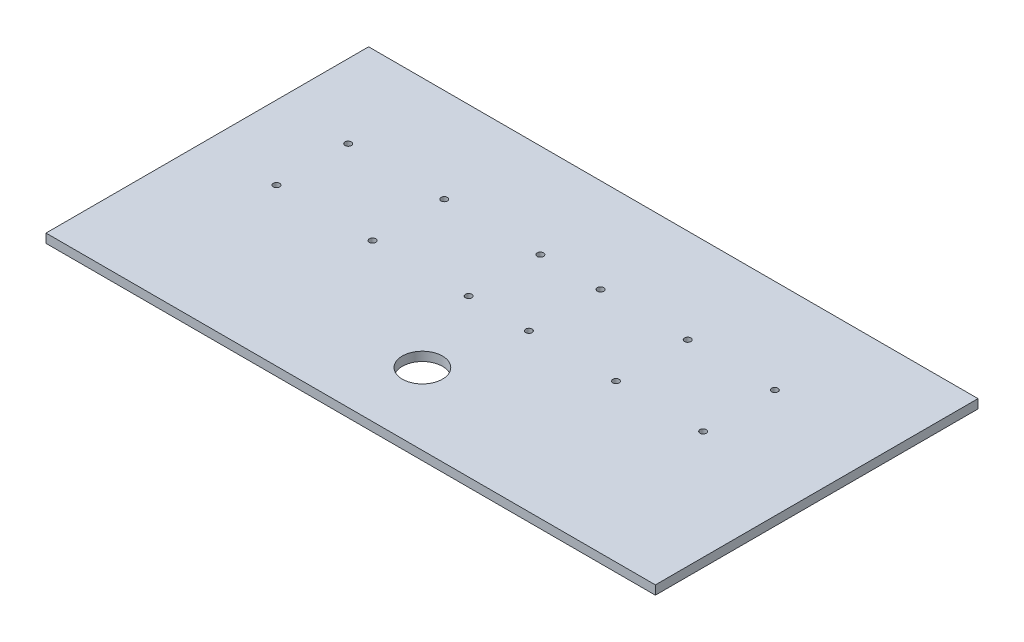
ISO-10303-21;
HEADER;
FILE_DESCRIPTION(('STEP AP214'),'2;1');
FILE_NAME('part.step','',(''),(''),'','','');
FILE_SCHEMA(('AUTOMOTIVE_DESIGN { 1 0 10303 214 1 1 1 1 }'));
ENDSEC;
DATA;
#1=APPLICATION_CONTEXT('core data for automotive mechanical design processes');
#2=APPLICATION_PROTOCOL_DEFINITION('international standard','automotive_design',2000,#1);
#3=PRODUCT_CONTEXT('',#1,'mechanical');
#4=PRODUCT('Part','Part','',(#3));
#5=PRODUCT_RELATED_PRODUCT_CATEGORY('part','',(#4));
#6=PRODUCT_DEFINITION_FORMATION('','',#4);
#7=PRODUCT_DEFINITION_CONTEXT('part definition',#1,'design');
#8=PRODUCT_DEFINITION('design','',#6,#7);
#9=PRODUCT_DEFINITION_SHAPE('','',#8);
#10=(LENGTH_UNIT() NAMED_UNIT(*) SI_UNIT(.MILLI.,.METRE.));
#11=(NAMED_UNIT(*) PLANE_ANGLE_UNIT() SI_UNIT($,.RADIAN.));
#12=(NAMED_UNIT(*) SI_UNIT($,.STERADIAN.) SOLID_ANGLE_UNIT());
#13=UNCERTAINTY_MEASURE_WITH_UNIT(LENGTH_MEASURE(1.E-05),#10,'distance_accuracy_value','');
#14=(GEOMETRIC_REPRESENTATION_CONTEXT(3) GLOBAL_UNCERTAINTY_ASSIGNED_CONTEXT((#13)) GLOBAL_UNIT_ASSIGNED_CONTEXT((#10,
#11,#12)) REPRESENTATION_CONTEXT('',''));
#15=CARTESIAN_POINT('',(0.,0.,0.));
#16=DIRECTION('',(0.,0.,1.));
#17=DIRECTION('',(1.,0.,0.));
#18=AXIS2_PLACEMENT_3D('',#15,#16,#17);
#19=CARTESIAN_POINT('',(0.,6.35,0.));
#20=DIRECTION('',(1.,0.,0.));
#21=DIRECTION('',(0.,0.,-1.));
#22=AXIS2_PLACEMENT_3D('',#19,#20,#21);
#23=PLANE('',#22);
#24=DIRECTION('',(0.,0.,1.));
#25=VECTOR('',#24,1.);
#26=CARTESIAN_POINT('',(0.,0.,0.));
#27=LINE('',#26,#25);
#28=CARTESIAN_POINT('',(0.,0.,-228.6));
#29=VERTEX_POINT('',#28);
#30=CARTESIAN_POINT('',(0.,0.,0.));
#31=VERTEX_POINT('',#30);
#32=EDGE_CURVE('E96',#29,#31,#27,.T.);
#33=ORIENTED_EDGE('',*,*,#32,.T.);
#34=DIRECTION('',(0.,-1.,0.));
#35=VECTOR('',#34,1.);
#36=CARTESIAN_POINT('',(0.,6.35,0.));
#37=LINE('',#36,#35);
#38=CARTESIAN_POINT('',(0.,6.35,0.));
#39=VERTEX_POINT('',#38);
#40=EDGE_CURVE('E11',#39,#31,#37,.T.);
#41=ORIENTED_EDGE('',*,*,#40,.F.);
#42=DIRECTION('',(0.,0.,1.));
#43=VECTOR('',#42,1.);
#44=CARTESIAN_POINT('',(0.,6.35,0.));
#45=LINE('',#44,#43);
#46=CARTESIAN_POINT('',(0.,6.35,-228.6));
#47=VERTEX_POINT('',#46);
#48=EDGE_CURVE('E84',#47,#39,#45,.T.);
#49=ORIENTED_EDGE('',*,*,#48,.F.);
#50=DIRECTION('',(0.,-1.,0.));
#51=VECTOR('',#50,1.);
#52=CARTESIAN_POINT('',(0.,6.35,-228.6));
#53=LINE('',#52,#51);
#54=EDGE_CURVE('E92',#47,#29,#53,.T.);
#55=ORIENTED_EDGE('',*,*,#54,.T.);
#56=EDGE_LOOP('',(#33,#41,#49,#55));
#57=FACE_BOUND('',#56,.T.);
#58=ADVANCED_FACE('F33',(#57),#23,.F.);
#59=CARTESIAN_POINT('',(0.,6.35,0.));
#60=DIRECTION('',(0.,0.,-1.));
#61=DIRECTION('',(-1.,0.,0.));
#62=AXIS2_PLACEMENT_3D('',#59,#60,#61);
#63=PLANE('',#62);
#64=DIRECTION('',(1.,0.,0.));
#65=VECTOR('',#64,1.);
#66=CARTESIAN_POINT('',(0.,0.,0.));
#67=LINE('',#66,#65);
#68=CARTESIAN_POINT('',(431.8,0.,0.));
#69=VERTEX_POINT('',#68);
#70=EDGE_CURVE('E88',#31,#69,#67,.T.);
#71=ORIENTED_EDGE('',*,*,#70,.T.);
#72=DIRECTION('',(0.,-1.,0.));
#73=VECTOR('',#72,1.);
#74=CARTESIAN_POINT('',(431.8,6.35,0.));
#75=LINE('',#74,#73);
#76=CARTESIAN_POINT('',(431.8,6.35,0.));
#77=VERTEX_POINT('',#76);
#78=EDGE_CURVE('E41',#77,#69,#75,.T.);
#79=ORIENTED_EDGE('',*,*,#78,.F.);
#80=DIRECTION('',(1.,0.,0.));
#81=VECTOR('',#80,1.);
#82=CARTESIAN_POINT('',(0.,6.35,0.));
#83=LINE('',#82,#81);
#84=EDGE_CURVE('E79',#39,#77,#83,.T.);
#85=ORIENTED_EDGE('',*,*,#84,.F.);
#86=ORIENTED_EDGE('',*,*,#40,.T.);
#87=EDGE_LOOP('',(#71,#79,#85,#86));
#88=FACE_BOUND('',#87,.T.);
#89=ADVANCED_FACE('F87',(#88),#63,.F.);
#90=CARTESIAN_POINT('',(431.8,6.35,0.));
#91=DIRECTION('',(-1.,0.,0.));
#92=DIRECTION('',(0.,0.,1.));
#93=AXIS2_PLACEMENT_3D('',#90,#91,#92);
#94=PLANE('',#93);
#95=DIRECTION('',(0.,0.,-1.));
#96=VECTOR('',#95,1.);
#97=CARTESIAN_POINT('',(431.8,0.,0.));
#98=LINE('',#97,#96);
#99=CARTESIAN_POINT('',(431.8,0.,-228.6));
#100=VERTEX_POINT('',#99);
#101=EDGE_CURVE('E66',#69,#100,#98,.T.);
#102=ORIENTED_EDGE('',*,*,#101,.T.);
#103=DIRECTION('',(0.,-1.,0.));
#104=VECTOR('',#103,1.);
#105=CARTESIAN_POINT('',(431.8,6.35,-228.6));
#106=LINE('',#105,#104);
#107=CARTESIAN_POINT('',(431.8,6.35,-228.6));
#108=VERTEX_POINT('',#107);
#109=EDGE_CURVE('E89',#108,#100,#106,.T.);
#110=ORIENTED_EDGE('',*,*,#109,.F.);
#111=DIRECTION('',(0.,0.,-1.));
#112=VECTOR('',#111,1.);
#113=CARTESIAN_POINT('',(431.8,6.35,0.));
#114=LINE('',#113,#112);
#115=EDGE_CURVE('E82',#77,#108,#114,.T.);
#116=ORIENTED_EDGE('',*,*,#115,.F.);
#117=ORIENTED_EDGE('',*,*,#78,.T.);
#118=EDGE_LOOP('',(#102,#110,#116,#117));
#119=FACE_BOUND('',#118,.T.);
#120=ADVANCED_FACE('F90',(#119),#94,.F.);
#121=CARTESIAN_POINT('',(0.,6.35,-228.6));
#122=DIRECTION('',(0.,0.,1.));
#123=DIRECTION('',(1.,0.,0.));
#124=AXIS2_PLACEMENT_3D('',#121,#122,#123);
#125=PLANE('',#124);
#126=DIRECTION('',(-1.,0.,0.));
#127=VECTOR('',#126,1.);
#128=CARTESIAN_POINT('',(0.,0.,-228.6));
#129=LINE('',#128,#127);
#130=EDGE_CURVE('E72',#100,#29,#129,.T.);
#131=ORIENTED_EDGE('',*,*,#130,.T.);
#132=ORIENTED_EDGE('',*,*,#54,.F.);
#133=DIRECTION('',(-1.,0.,0.));
#134=VECTOR('',#133,1.);
#135=CARTESIAN_POINT('',(0.,6.35,-228.6));
#136=LINE('',#135,#134);
#137=EDGE_CURVE('E49',#108,#47,#136,.T.);
#138=ORIENTED_EDGE('',*,*,#137,.F.);
#139=ORIENTED_EDGE('',*,*,#109,.T.);
#140=EDGE_LOOP('',(#131,#132,#138,#139));
#141=FACE_BOUND('',#140,.T.);
#142=ADVANCED_FACE('F104',(#141),#125,.F.);
#143=CARTESIAN_POINT('',(0.,6.35,0.));
#144=DIRECTION('',(0.,-1.,0.));
#145=DIRECTION('',(0.,0.,-1.));
#146=AXIS2_PLACEMENT_3D('',#143,#144,#145);
#147=PLANE('',#146);
#148=CARTESIAN_POINT('',(354.543204994444,6.35,-161.881338493265));
#149=DIRECTION('',(0.,-1.,0.));
#150=DIRECTION('',(0.,0.,-1.));
#151=AXIS2_PLACEMENT_3D('',#148,#149,#150);
#152=CIRCLE('',#151,2.24966072799998);
#153=CARTESIAN_POINT('',(354.543204994444,6.35,-164.130999221265));
#154=VERTEX_POINT('',#153);
#155=EDGE_CURVE('E181',#154,#154,#152,.T.);
#156=ORIENTED_EDGE('',*,*,#155,.T.);
#157=EDGE_LOOP('',(#156));
#158=FACE_BOUND('',#157,.T.);
#159=CARTESIAN_POINT('',(354.543204994444,6.35,-111.081338493265));
#160=DIRECTION('',(0.,-1.,0.));
#161=DIRECTION('',(0.,0.,-1.));
#162=AXIS2_PLACEMENT_3D('',#159,#160,#161);
#163=CIRCLE('',#162,2.24966072799997);
#164=CARTESIAN_POINT('',(354.543204994444,6.35,-113.330999221265));
#165=VERTEX_POINT('',#164);
#166=EDGE_CURVE('E175',#165,#165,#163,.T.);
#167=ORIENTED_EDGE('',*,*,#166,.T.);
#168=EDGE_LOOP('',(#167));
#169=FACE_BOUND('',#168,.T.);
#170=CARTESIAN_POINT('',(292.811126449158,6.35,-161.881338493265));
#171=DIRECTION('',(0.,-1.,0.));
#172=DIRECTION('',(0.,0.,-1.));
#173=AXIS2_PLACEMENT_3D('',#170,#171,#172);
#174=CIRCLE('',#173,2.24966072799998);
#175=CARTESIAN_POINT('',(292.811126449158,6.35,-164.130999221265));
#176=VERTEX_POINT('',#175);
#177=EDGE_CURVE('E169',#176,#176,#174,.T.);
#178=ORIENTED_EDGE('',*,*,#177,.T.);
#179=EDGE_LOOP('',(#178));
#180=FACE_BOUND('',#179,.T.);
#181=CARTESIAN_POINT('',(292.811126449158,6.35,-111.081338493265));
#182=DIRECTION('',(0.,-1.,0.));
#183=DIRECTION('',(0.,0.,-1.));
#184=AXIS2_PLACEMENT_3D('',#181,#182,#183);
#185=CIRCLE('',#184,2.24966072799997);
#186=CARTESIAN_POINT('',(292.811126449158,6.35,-113.330999221265));
#187=VERTEX_POINT('',#186);
#188=EDGE_CURVE('E163',#187,#187,#185,.T.);
#189=ORIENTED_EDGE('',*,*,#188,.T.);
#190=EDGE_LOOP('',(#189));
#191=FACE_BOUND('',#190,.T.);
#192=CARTESIAN_POINT('',(231.079047903872,6.35,-161.881338493265));
#193=DIRECTION('',(0.,-1.,0.));
#194=DIRECTION('',(0.,0.,-1.));
#195=AXIS2_PLACEMENT_3D('',#192,#193,#194);
#196=CIRCLE('',#195,2.24966072799998);
#197=CARTESIAN_POINT('',(231.079047903872,6.35,-164.130999221265));
#198=VERTEX_POINT('',#197);
#199=EDGE_CURVE('E157',#198,#198,#196,.T.);
#200=ORIENTED_EDGE('',*,*,#199,.T.);
#201=EDGE_LOOP('',(#200));
#202=FACE_BOUND('',#201,.T.);
#203=CARTESIAN_POINT('',(231.079047903872,6.35,-111.081338493265));
#204=DIRECTION('',(0.,-1.,0.));
#205=DIRECTION('',(0.,0.,-1.));
#206=AXIS2_PLACEMENT_3D('',#203,#204,#205);
#207=CIRCLE('',#206,2.24967596978228);
#208=CARTESIAN_POINT('',(231.079047903872,6.35,-113.331014463047));
#209=VERTEX_POINT('',#208);
#210=EDGE_CURVE('E151',#209,#209,#207,.T.);
#211=ORIENTED_EDGE('',*,*,#210,.T.);
#212=EDGE_LOOP('',(#211));
#213=FACE_BOUND('',#212,.T.);
#214=CARTESIAN_POINT('',(188.396969358586,6.35,-161.881338493265));
#215=DIRECTION('',(0.,-1.,0.));
#216=DIRECTION('',(0.,0.,-1.));
#217=AXIS2_PLACEMENT_3D('',#214,#215,#216);
#218=CIRCLE('',#217,2.249660728);
#219=CARTESIAN_POINT('',(188.396969358586,6.35,-164.130999221265));
#220=VERTEX_POINT('',#219);
#221=EDGE_CURVE('E145',#220,#220,#218,.T.);
#222=ORIENTED_EDGE('',*,*,#221,.T.);
#223=EDGE_LOOP('',(#222));
#224=FACE_BOUND('',#223,.T.);
#225=CARTESIAN_POINT('',(188.396969358586,6.35,-111.081338493265));
#226=DIRECTION('',(0.,-1.,0.));
#227=DIRECTION('',(0.,0.,-1.));
#228=AXIS2_PLACEMENT_3D('',#225,#226,#227);
#229=CIRCLE('',#228,2.24966073929724);
#230=CARTESIAN_POINT('',(188.396969358586,6.35,-113.330999232562));
#231=VERTEX_POINT('',#230);
#232=EDGE_CURVE('E139',#231,#231,#229,.T.);
#233=ORIENTED_EDGE('',*,*,#232,.T.);
#234=EDGE_LOOP('',(#233));
#235=FACE_BOUND('',#234,.T.);
#236=CARTESIAN_POINT('',(120.3148908133,6.35,-161.881338493265));
#237=DIRECTION('',(0.,-1.,0.));
#238=DIRECTION('',(0.,0.,-1.));
#239=AXIS2_PLACEMENT_3D('',#236,#237,#238);
#240=CIRCLE('',#239,2.24967596978235);
#241=CARTESIAN_POINT('',(120.3148908133,6.35,-164.131014463047));
#242=VERTEX_POINT('',#241);
#243=EDGE_CURVE('E133',#242,#242,#240,.T.);
#244=ORIENTED_EDGE('',*,*,#243,.T.);
#245=EDGE_LOOP('',(#244));
#246=FACE_BOUND('',#245,.T.);
#247=CARTESIAN_POINT('',(120.3148908133,6.35,-111.081338493265));
#248=DIRECTION('',(0.,-1.,0.));
#249=DIRECTION('',(0.,0.,-1.));
#250=AXIS2_PLACEMENT_3D('',#247,#248,#249);
#251=CIRCLE('',#250,2.24967596978235);
#252=CARTESIAN_POINT('',(120.3148908133,6.35,-113.331014463047));
#253=VERTEX_POINT('',#252);
#254=EDGE_CURVE('E127',#253,#253,#251,.T.);
#255=ORIENTED_EDGE('',*,*,#254,.T.);
#256=EDGE_LOOP('',(#255));
#257=FACE_BOUND('',#256,.T.);
#258=CARTESIAN_POINT('',(52.232812268014,6.35,-161.881338493265));
#259=DIRECTION('',(0.,-1.,0.));
#260=DIRECTION('',(0.,0.,-1.));
#261=AXIS2_PLACEMENT_3D('',#258,#259,#260);
#262=CIRCLE('',#261,2.24967596978233);
#263=CARTESIAN_POINT('',(52.232812268014,6.35,-164.131014463047));
#264=VERTEX_POINT('',#263);
#265=EDGE_CURVE('E121',#264,#264,#262,.T.);
#266=ORIENTED_EDGE('',*,*,#265,.T.);
#267=EDGE_LOOP('',(#266));
#268=FACE_BOUND('',#267,.T.);
#269=CARTESIAN_POINT('',(52.232812268014,6.35,-111.081338493265));
#270=DIRECTION('',(0.,-1.,0.));
#271=DIRECTION('',(0.,0.,-1.));
#272=AXIS2_PLACEMENT_3D('',#269,#270,#271);
#273=CIRCLE('',#272,2.24967596978229);
#274=CARTESIAN_POINT('',(52.232812268014,6.35,-113.331014463047));
#275=VERTEX_POINT('',#274);
#276=EDGE_CURVE('E113',#275,#275,#273,.T.);
#277=ORIENTED_EDGE('',*,*,#276,.T.);
#278=EDGE_LOOP('',(#277));
#279=FACE_BOUND('',#278,.T.);
#280=CARTESIAN_POINT('',(215.9,6.35,-50.8));
#281=DIRECTION('',(0.,1.,0.));
#282=DIRECTION('',(0.,0.,1.));
#283=AXIS2_PLACEMENT_3D('',#280,#281,#282);
#284=CIRCLE('',#283,14.224);
#285=CARTESIAN_POINT('',(215.9,6.35,-36.576));
#286=VERTEX_POINT('',#285);
#287=EDGE_CURVE('E110',#286,#286,#284,.T.);
#288=ORIENTED_EDGE('',*,*,#287,.F.);
#289=EDGE_LOOP('',(#288));
#290=FACE_BOUND('',#289,.T.);
#291=ORIENTED_EDGE('',*,*,#48,.T.);
#292=ORIENTED_EDGE('',*,*,#84,.T.);
#293=ORIENTED_EDGE('',*,*,#115,.T.);
#294=ORIENTED_EDGE('',*,*,#137,.T.);
#295=EDGE_LOOP('',(#291,#292,#293,#294));
#296=FACE_BOUND('',#295,.T.);
#297=ADVANCED_FACE('F80',(#158,#169,#180,#191,#202,#213,#224,#235,#246,#257,#268,#279,#290,
#296),#147,.F.);
#298=CARTESIAN_POINT('',(0.,0.,0.));
#299=DIRECTION('',(0.,-1.,0.));
#300=DIRECTION('',(0.,0.,-1.));
#301=AXIS2_PLACEMENT_3D('',#298,#299,#300);
#302=PLANE('',#301);
#303=CARTESIAN_POINT('',(354.543204994444,0.,-161.881338493265));
#304=DIRECTION('',(0.,-1.,0.));
#305=DIRECTION('',(0.,0.,-1.));
#306=AXIS2_PLACEMENT_3D('',#303,#304,#305);
#307=CIRCLE('',#306,2.24966072799998);
#308=CARTESIAN_POINT('',(354.543204994444,0.,-164.130999221265));
#309=VERTEX_POINT('',#308);
#310=EDGE_CURVE('E184',#309,#309,#307,.T.);
#311=ORIENTED_EDGE('',*,*,#310,.F.);
#312=EDGE_LOOP('',(#311));
#313=FACE_BOUND('',#312,.T.);
#314=CARTESIAN_POINT('',(354.543204994444,0.,-111.081338493265));
#315=DIRECTION('',(0.,-1.,0.));
#316=DIRECTION('',(0.,0.,-1.));
#317=AXIS2_PLACEMENT_3D('',#314,#315,#316);
#318=CIRCLE('',#317,2.24966072799997);
#319=CARTESIAN_POINT('',(354.543204994444,0.,-113.330999221265));
#320=VERTEX_POINT('',#319);
#321=EDGE_CURVE('E178',#320,#320,#318,.T.);
#322=ORIENTED_EDGE('',*,*,#321,.F.);
#323=EDGE_LOOP('',(#322));
#324=FACE_BOUND('',#323,.T.);
#325=CARTESIAN_POINT('',(292.811126449158,0.,-161.881338493265));
#326=DIRECTION('',(0.,-1.,0.));
#327=DIRECTION('',(0.,0.,-1.));
#328=AXIS2_PLACEMENT_3D('',#325,#326,#327);
#329=CIRCLE('',#328,2.24966072799998);
#330=CARTESIAN_POINT('',(292.811126449158,0.,-164.130999221265));
#331=VERTEX_POINT('',#330);
#332=EDGE_CURVE('E172',#331,#331,#329,.T.);
#333=ORIENTED_EDGE('',*,*,#332,.F.);
#334=EDGE_LOOP('',(#333));
#335=FACE_BOUND('',#334,.T.);
#336=CARTESIAN_POINT('',(292.811126449158,0.,-111.081338493265));
#337=DIRECTION('',(0.,-1.,0.));
#338=DIRECTION('',(0.,0.,-1.));
#339=AXIS2_PLACEMENT_3D('',#336,#337,#338);
#340=CIRCLE('',#339,2.24966072799997);
#341=CARTESIAN_POINT('',(292.811126449158,0.,-113.330999221265));
#342=VERTEX_POINT('',#341);
#343=EDGE_CURVE('E166',#342,#342,#340,.T.);
#344=ORIENTED_EDGE('',*,*,#343,.F.);
#345=EDGE_LOOP('',(#344));
#346=FACE_BOUND('',#345,.T.);
#347=CARTESIAN_POINT('',(231.079047903872,0.,-161.881338493265));
#348=DIRECTION('',(0.,-1.,0.));
#349=DIRECTION('',(0.,0.,-1.));
#350=AXIS2_PLACEMENT_3D('',#347,#348,#349);
#351=CIRCLE('',#350,2.24966072799998);
#352=CARTESIAN_POINT('',(231.079047903872,0.,-164.130999221265));
#353=VERTEX_POINT('',#352);
#354=EDGE_CURVE('E160',#353,#353,#351,.T.);
#355=ORIENTED_EDGE('',*,*,#354,.F.);
#356=EDGE_LOOP('',(#355));
#357=FACE_BOUND('',#356,.T.);
#358=CARTESIAN_POINT('',(231.079047903872,0.,-111.081338493265));
#359=DIRECTION('',(0.,-1.,0.));
#360=DIRECTION('',(0.,0.,-1.));
#361=AXIS2_PLACEMENT_3D('',#358,#359,#360);
#362=CIRCLE('',#361,2.24967596978228);
#363=CARTESIAN_POINT('',(231.079047903872,0.,-113.331014463047));
#364=VERTEX_POINT('',#363);
#365=EDGE_CURVE('E154',#364,#364,#362,.T.);
#366=ORIENTED_EDGE('',*,*,#365,.F.);
#367=EDGE_LOOP('',(#366));
#368=FACE_BOUND('',#367,.T.);
#369=CARTESIAN_POINT('',(188.396969358586,0.,-161.881338493265));
#370=DIRECTION('',(0.,-1.,0.));
#371=DIRECTION('',(0.,0.,-1.));
#372=AXIS2_PLACEMENT_3D('',#369,#370,#371);
#373=CIRCLE('',#372,2.249660728);
#374=CARTESIAN_POINT('',(188.396969358586,0.,-164.130999221265));
#375=VERTEX_POINT('',#374);
#376=EDGE_CURVE('E148',#375,#375,#373,.T.);
#377=ORIENTED_EDGE('',*,*,#376,.F.);
#378=EDGE_LOOP('',(#377));
#379=FACE_BOUND('',#378,.T.);
#380=CARTESIAN_POINT('',(188.396969358586,0.,-111.081338493265));
#381=DIRECTION('',(0.,-1.,0.));
#382=DIRECTION('',(0.,0.,-1.));
#383=AXIS2_PLACEMENT_3D('',#380,#381,#382);
#384=CIRCLE('',#383,2.24966073929724);
#385=CARTESIAN_POINT('',(188.396969358586,0.,-113.330999232562));
#386=VERTEX_POINT('',#385);
#387=EDGE_CURVE('E142',#386,#386,#384,.T.);
#388=ORIENTED_EDGE('',*,*,#387,.F.);
#389=EDGE_LOOP('',(#388));
#390=FACE_BOUND('',#389,.T.);
#391=CARTESIAN_POINT('',(120.3148908133,0.,-161.881338493265));
#392=DIRECTION('',(0.,-1.,0.));
#393=DIRECTION('',(0.,0.,-1.));
#394=AXIS2_PLACEMENT_3D('',#391,#392,#393);
#395=CIRCLE('',#394,2.24967596978235);
#396=CARTESIAN_POINT('',(120.3148908133,0.,-164.131014463047));
#397=VERTEX_POINT('',#396);
#398=EDGE_CURVE('E136',#397,#397,#395,.T.);
#399=ORIENTED_EDGE('',*,*,#398,.F.);
#400=EDGE_LOOP('',(#399));
#401=FACE_BOUND('',#400,.T.);
#402=CARTESIAN_POINT('',(120.3148908133,0.,-111.081338493265));
#403=DIRECTION('',(0.,-1.,0.));
#404=DIRECTION('',(0.,0.,-1.));
#405=AXIS2_PLACEMENT_3D('',#402,#403,#404);
#406=CIRCLE('',#405,2.24967596978235);
#407=CARTESIAN_POINT('',(120.3148908133,0.,-113.331014463047));
#408=VERTEX_POINT('',#407);
#409=EDGE_CURVE('E130',#408,#408,#406,.T.);
#410=ORIENTED_EDGE('',*,*,#409,.F.);
#411=EDGE_LOOP('',(#410));
#412=FACE_BOUND('',#411,.T.);
#413=CARTESIAN_POINT('',(52.232812268014,0.,-161.881338493265));
#414=DIRECTION('',(0.,-1.,0.));
#415=DIRECTION('',(0.,0.,-1.));
#416=AXIS2_PLACEMENT_3D('',#413,#414,#415);
#417=CIRCLE('',#416,2.24967596978233);
#418=CARTESIAN_POINT('',(52.232812268014,0.,-164.131014463047));
#419=VERTEX_POINT('',#418);
#420=EDGE_CURVE('E124',#419,#419,#417,.T.);
#421=ORIENTED_EDGE('',*,*,#420,.F.);
#422=EDGE_LOOP('',(#421));
#423=FACE_BOUND('',#422,.T.);
#424=CARTESIAN_POINT('',(52.232812268014,0.,-111.081338493265));
#425=DIRECTION('',(0.,-1.,0.));
#426=DIRECTION('',(0.,0.,-1.));
#427=AXIS2_PLACEMENT_3D('',#424,#425,#426);
#428=CIRCLE('',#427,2.24967596978229);
#429=CARTESIAN_POINT('',(52.232812268014,0.,-113.331014463047));
#430=VERTEX_POINT('',#429);
#431=EDGE_CURVE('E118',#430,#430,#428,.T.);
#432=ORIENTED_EDGE('',*,*,#431,.F.);
#433=EDGE_LOOP('',(#432));
#434=FACE_BOUND('',#433,.T.);
#435=CARTESIAN_POINT('',(215.9,0.,-50.8));
#436=DIRECTION('',(0.,1.,0.));
#437=DIRECTION('',(0.,0.,1.));
#438=AXIS2_PLACEMENT_3D('',#435,#436,#437);
#439=CIRCLE('',#438,14.224);
#440=CARTESIAN_POINT('',(215.9,0.,-36.576));
#441=VERTEX_POINT('',#440);
#442=EDGE_CURVE('E99',#441,#441,#439,.T.);
#443=ORIENTED_EDGE('',*,*,#442,.T.);
#444=EDGE_LOOP('',(#443));
#445=FACE_BOUND('',#444,.T.);
#446=ORIENTED_EDGE('',*,*,#32,.F.);
#447=ORIENTED_EDGE('',*,*,#130,.F.);
#448=ORIENTED_EDGE('',*,*,#101,.F.);
#449=ORIENTED_EDGE('',*,*,#70,.F.);
#450=EDGE_LOOP('',(#446,#447,#448,#449));
#451=FACE_BOUND('',#450,.T.);
#452=ADVANCED_FACE('F107',(#313,#324,#335,#346,#357,#368,#379,#390,#401,#412,#423,#434,#445,
#451),#302,.T.);
#453=CARTESIAN_POINT('',(215.9,0.,-50.8));
#454=DIRECTION('',(0.,1.,0.));
#455=DIRECTION('',(0.,0.,1.));
#456=AXIS2_PLACEMENT_3D('',#453,#454,#455);
#457=CYLINDRICAL_SURFACE('',#456,14.224);
#458=ORIENTED_EDGE('',*,*,#442,.F.);
#459=EDGE_LOOP('',(#458));
#460=FACE_BOUND('',#459,.T.);
#461=ORIENTED_EDGE('',*,*,#287,.T.);
#462=EDGE_LOOP('',(#461));
#463=FACE_BOUND('',#462,.T.);
#464=ADVANCED_FACE('F193',(#460,#463),#457,.F.);
#465=CARTESIAN_POINT('',(52.232812268014,25.4,-111.081338493265));
#466=DIRECTION('',(0.,-1.,0.));
#467=DIRECTION('',(0.,0.,-1.));
#468=AXIS2_PLACEMENT_3D('',#465,#466,#467);
#469=CYLINDRICAL_SURFACE('',#468,2.24967596978229);
#470=ORIENTED_EDGE('',*,*,#431,.T.);
#471=EDGE_LOOP('',(#470));
#472=FACE_BOUND('',#471,.T.);
#473=ORIENTED_EDGE('',*,*,#276,.F.);
#474=EDGE_LOOP('',(#473));
#475=FACE_BOUND('',#474,.T.);
#476=ADVANCED_FACE('F221',(#472,#475),#469,.F.);
#477=CARTESIAN_POINT('',(52.232812268014,25.4,-161.881338493265));
#478=DIRECTION('',(0.,-1.,0.));
#479=DIRECTION('',(0.,0.,-1.));
#480=AXIS2_PLACEMENT_3D('',#477,#478,#479);
#481=CYLINDRICAL_SURFACE('',#480,2.24967596978233);
#482=ORIENTED_EDGE('',*,*,#420,.T.);
#483=EDGE_LOOP('',(#482));
#484=FACE_BOUND('',#483,.T.);
#485=ORIENTED_EDGE('',*,*,#265,.F.);
#486=EDGE_LOOP('',(#485));
#487=FACE_BOUND('',#486,.T.);
#488=ADVANCED_FACE('F264',(#484,#487),#481,.F.);
#489=CARTESIAN_POINT('',(120.3148908133,25.4,-111.081338493265));
#490=DIRECTION('',(0.,-1.,0.));
#491=DIRECTION('',(0.,0.,-1.));
#492=AXIS2_PLACEMENT_3D('',#489,#490,#491);
#493=CYLINDRICAL_SURFACE('',#492,2.24967596978235);
#494=ORIENTED_EDGE('',*,*,#409,.T.);
#495=EDGE_LOOP('',(#494));
#496=FACE_BOUND('',#495,.T.);
#497=ORIENTED_EDGE('',*,*,#254,.F.);
#498=EDGE_LOOP('',(#497));
#499=FACE_BOUND('',#498,.T.);
#500=ADVANCED_FACE('F274',(#496,#499),#493,.F.);
#501=CARTESIAN_POINT('',(120.3148908133,25.4,-161.881338493265));
#502=DIRECTION('',(0.,-1.,0.));
#503=DIRECTION('',(0.,0.,-1.));
#504=AXIS2_PLACEMENT_3D('',#501,#502,#503);
#505=CYLINDRICAL_SURFACE('',#504,2.24967596978235);
#506=ORIENTED_EDGE('',*,*,#398,.T.);
#507=EDGE_LOOP('',(#506));
#508=FACE_BOUND('',#507,.T.);
#509=ORIENTED_EDGE('',*,*,#243,.F.);
#510=EDGE_LOOP('',(#509));
#511=FACE_BOUND('',#510,.T.);
#512=ADVANCED_FACE('F284',(#508,#511),#505,.F.);
#513=CARTESIAN_POINT('',(188.396969358586,25.4,-111.081338493265));
#514=DIRECTION('',(0.,-1.,0.));
#515=DIRECTION('',(0.,0.,-1.));
#516=AXIS2_PLACEMENT_3D('',#513,#514,#515);
#517=CYLINDRICAL_SURFACE('',#516,2.24966073929724);
#518=ORIENTED_EDGE('',*,*,#387,.T.);
#519=EDGE_LOOP('',(#518));
#520=FACE_BOUND('',#519,.T.);
#521=ORIENTED_EDGE('',*,*,#232,.F.);
#522=EDGE_LOOP('',(#521));
#523=FACE_BOUND('',#522,.T.);
#524=ADVANCED_FACE('F294',(#520,#523),#517,.F.);
#525=CARTESIAN_POINT('',(188.396969358586,25.4,-161.881338493265));
#526=DIRECTION('',(0.,-1.,0.));
#527=DIRECTION('',(0.,0.,-1.));
#528=AXIS2_PLACEMENT_3D('',#525,#526,#527);
#529=CYLINDRICAL_SURFACE('',#528,2.249660728);
#530=ORIENTED_EDGE('',*,*,#376,.T.);
#531=EDGE_LOOP('',(#530));
#532=FACE_BOUND('',#531,.T.);
#533=ORIENTED_EDGE('',*,*,#221,.F.);
#534=EDGE_LOOP('',(#533));
#535=FACE_BOUND('',#534,.T.);
#536=ADVANCED_FACE('F304',(#532,#535),#529,.F.);
#537=CARTESIAN_POINT('',(231.079047903872,25.4,-111.081338493265));
#538=DIRECTION('',(0.,-1.,0.));
#539=DIRECTION('',(0.,0.,-1.));
#540=AXIS2_PLACEMENT_3D('',#537,#538,#539);
#541=CYLINDRICAL_SURFACE('',#540,2.24967596978228);
#542=ORIENTED_EDGE('',*,*,#365,.T.);
#543=EDGE_LOOP('',(#542));
#544=FACE_BOUND('',#543,.T.);
#545=ORIENTED_EDGE('',*,*,#210,.F.);
#546=EDGE_LOOP('',(#545));
#547=FACE_BOUND('',#546,.T.);
#548=ADVANCED_FACE('F313',(#544,#547),#541,.F.);
#549=CARTESIAN_POINT('',(231.079047903872,25.4,-161.881338493265));
#550=DIRECTION('',(0.,-1.,0.));
#551=DIRECTION('',(0.,0.,-1.));
#552=AXIS2_PLACEMENT_3D('',#549,#550,#551);
#553=CYLINDRICAL_SURFACE('',#552,2.24966072799998);
#554=ORIENTED_EDGE('',*,*,#354,.T.);
#555=EDGE_LOOP('',(#554));
#556=FACE_BOUND('',#555,.T.);
#557=ORIENTED_EDGE('',*,*,#199,.F.);
#558=EDGE_LOOP('',(#557));
#559=FACE_BOUND('',#558,.T.);
#560=ADVANCED_FACE('F332',(#556,#559),#553,.F.);
#561=CARTESIAN_POINT('',(292.811126449158,25.4,-111.081338493265));
#562=DIRECTION('',(0.,-1.,0.));
#563=DIRECTION('',(0.,0.,-1.));
#564=AXIS2_PLACEMENT_3D('',#561,#562,#563);
#565=CYLINDRICAL_SURFACE('',#564,2.24966072799997);
#566=ORIENTED_EDGE('',*,*,#343,.T.);
#567=EDGE_LOOP('',(#566));
#568=FACE_BOUND('',#567,.T.);
#569=ORIENTED_EDGE('',*,*,#188,.F.);
#570=EDGE_LOOP('',(#569));
#571=FACE_BOUND('',#570,.T.);
#572=ADVANCED_FACE('F342',(#568,#571),#565,.F.);
#573=CARTESIAN_POINT('',(292.811126449158,25.4,-161.881338493265));
#574=DIRECTION('',(0.,-1.,0.));
#575=DIRECTION('',(0.,0.,-1.));
#576=AXIS2_PLACEMENT_3D('',#573,#574,#575);
#577=CYLINDRICAL_SURFACE('',#576,2.24966072799998);
#578=ORIENTED_EDGE('',*,*,#332,.T.);
#579=EDGE_LOOP('',(#578));
#580=FACE_BOUND('',#579,.T.);
#581=ORIENTED_EDGE('',*,*,#177,.F.);
#582=EDGE_LOOP('',(#581));
#583=FACE_BOUND('',#582,.T.);
#584=ADVANCED_FACE('F352',(#580,#583),#577,.F.);
#585=CARTESIAN_POINT('',(354.543204994444,25.4,-111.081338493265));
#586=DIRECTION('',(0.,-1.,0.));
#587=DIRECTION('',(0.,0.,-1.));
#588=AXIS2_PLACEMENT_3D('',#585,#586,#587);
#589=CYLINDRICAL_SURFACE('',#588,2.24966072799997);
#590=ORIENTED_EDGE('',*,*,#321,.T.);
#591=EDGE_LOOP('',(#590));
#592=FACE_BOUND('',#591,.T.);
#593=ORIENTED_EDGE('',*,*,#166,.F.);
#594=EDGE_LOOP('',(#593));
#595=FACE_BOUND('',#594,.T.);
#596=ADVANCED_FACE('F362',(#592,#595),#589,.F.);
#597=CARTESIAN_POINT('',(354.543204994444,25.4,-161.881338493265));
#598=DIRECTION('',(0.,-1.,0.));
#599=DIRECTION('',(0.,0.,-1.));
#600=AXIS2_PLACEMENT_3D('',#597,#598,#599);
#601=CYLINDRICAL_SURFACE('',#600,2.24966072799998);
#602=ORIENTED_EDGE('',*,*,#310,.T.);
#603=EDGE_LOOP('',(#602));
#604=FACE_BOUND('',#603,.T.);
#605=ORIENTED_EDGE('',*,*,#155,.F.);
#606=EDGE_LOOP('',(#605));
#607=FACE_BOUND('',#606,.T.);
#608=ADVANCED_FACE('F188',(#604,#607),#601,.F.);
#609=CLOSED_SHELL('',(#58,#89,#120,#142,#297,#452,#464,#476,#488,#500,#512,#524,#536,#548,#560,
#572,#584,#596,#608));
#610=MANIFOLD_SOLID_BREP('B2',#609);
#611=ADVANCED_BREP_SHAPE_REPRESENTATION('',(#18,#610),#14);
#612=SHAPE_DEFINITION_REPRESENTATION(#9,#611);
ENDSEC;
END-ISO-10303-21;
